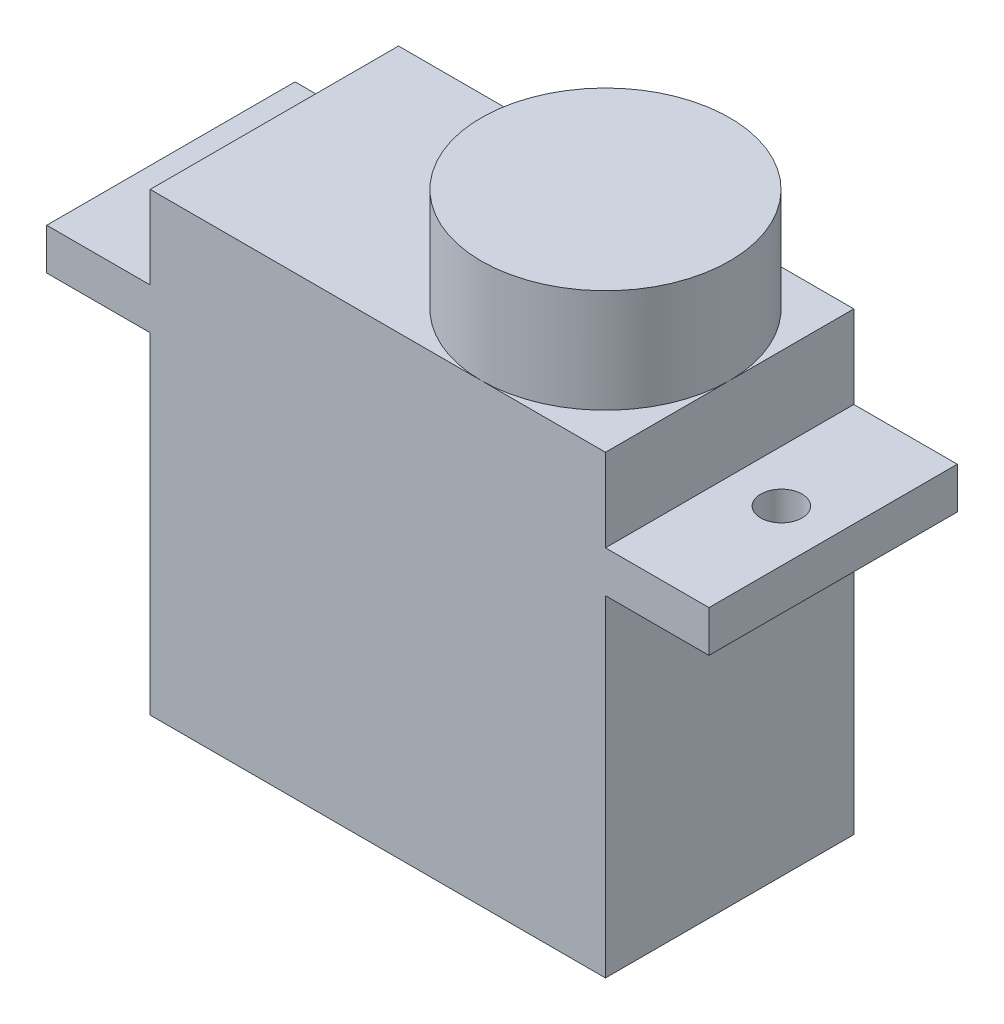
ISO-10303-21;
HEADER;
FILE_DESCRIPTION(('STEP AP214'),'2;1');
FILE_NAME('part.step','',(''),(''),'','','');
FILE_SCHEMA(('AUTOMOTIVE_DESIGN { 1 0 10303 214 1 1 1 1 }'));
ENDSEC;
DATA;
#1=APPLICATION_CONTEXT('core data for automotive mechanical design processes');
#2=APPLICATION_PROTOCOL_DEFINITION('international standard','automotive_design',2000,#1);
#3=PRODUCT_CONTEXT('',#1,'mechanical');
#4=PRODUCT('Part','Part','',(#3));
#5=PRODUCT_RELATED_PRODUCT_CATEGORY('part','',(#4));
#6=PRODUCT_DEFINITION_FORMATION('','',#4);
#7=PRODUCT_DEFINITION_CONTEXT('part definition',#1,'design');
#8=PRODUCT_DEFINITION('design','',#6,#7);
#9=PRODUCT_DEFINITION_SHAPE('','',#8);
#10=(LENGTH_UNIT() NAMED_UNIT(*) SI_UNIT(.MILLI.,.METRE.));
#11=(NAMED_UNIT(*) PLANE_ANGLE_UNIT() SI_UNIT($,.RADIAN.));
#12=(NAMED_UNIT(*) SI_UNIT($,.STERADIAN.) SOLID_ANGLE_UNIT());
#13=UNCERTAINTY_MEASURE_WITH_UNIT(LENGTH_MEASURE(1.E-05),#10,'distance_accuracy_value','');
#14=(GEOMETRIC_REPRESENTATION_CONTEXT(3) GLOBAL_UNCERTAINTY_ASSIGNED_CONTEXT((#13)) GLOBAL_UNIT_ASSIGNED_CONTEXT((#10,
#11,#12)) REPRESENTATION_CONTEXT('',''));
#15=CARTESIAN_POINT('',(0.,0.,0.));
#16=DIRECTION('',(0.,0.,1.));
#17=DIRECTION('',(1.,0.,0.));
#18=AXIS2_PLACEMENT_3D('',#15,#16,#17);
#19=CARTESIAN_POINT('',(0.,22.,-12.));
#20=DIRECTION('',(0.,-1.,0.));
#21=DIRECTION('',(0.,0.,-1.));
#22=AXIS2_PLACEMENT_3D('',#19,#20,#21);
#23=PLANE('',#22);
#24=CARTESIAN_POINT('',(16.,22.,-6.));
#25=DIRECTION('',(0.,1.,0.));
#26=DIRECTION('',(0.,0.,1.));
#27=AXIS2_PLACEMENT_3D('',#24,#25,#26);
#28=CIRCLE('',#27,6.);
#29=CARTESIAN_POINT('',(16.,22.,0.));
#30=VERTEX_POINT('',#29);
#31=CARTESIAN_POINT('',(22.,22.,-6.));
#32=VERTEX_POINT('',#31);
#33=EDGE_CURVE('E47',#30,#32,#28,.T.);
#34=ORIENTED_EDGE('',*,*,#33,.F.);
#35=DIRECTION('',(1.,0.,0.));
#36=VECTOR('',#35,1.);
#37=CARTESIAN_POINT('',(0.,22.,0.));
#38=LINE('',#37,#36);
#39=CARTESIAN_POINT('',(22.,22.,0.));
#40=VERTEX_POINT('',#39);
#41=EDGE_CURVE('E142',#30,#40,#38,.T.);
#42=ORIENTED_EDGE('',*,*,#41,.T.);
#43=DIRECTION('',(0.,0.,-1.));
#44=VECTOR('',#43,1.);
#45=CARTESIAN_POINT('',(22.,22.,0.));
#46=LINE('',#45,#44);
#47=EDGE_CURVE('E153',#40,#32,#46,.T.);
#48=ORIENTED_EDGE('',*,*,#47,.T.);
#49=EDGE_LOOP('',(#34,#42,#48));
#50=FACE_BOUND('',#49,.T.);
#51=ADVANCED_FACE('F36',(#50),#23,.F.);
#52=CARTESIAN_POINT('',(16.,22.,-12.));
#53=VERTEX_POINT('',#52);
#54=EDGE_CURVE('E11',#32,#53,#28,.T.);
#55=ORIENTED_EDGE('',*,*,#54,.F.);
#56=CARTESIAN_POINT('',(22.,22.,-12.));
#57=VERTEX_POINT('',#56);
#58=EDGE_CURVE('E141',#32,#57,#46,.T.);
#59=ORIENTED_EDGE('',*,*,#58,.T.);
#60=DIRECTION('',(-1.,0.,0.));
#61=VECTOR('',#60,1.);
#62=CARTESIAN_POINT('',(0.,22.,-12.));
#63=LINE('',#62,#61);
#64=EDGE_CURVE('E221',#57,#53,#63,.T.);
#65=ORIENTED_EDGE('',*,*,#64,.T.);
#66=EDGE_LOOP('',(#55,#59,#65));
#67=FACE_BOUND('',#66,.T.);
#68=ADVANCED_FACE('F274',(#67),#23,.F.);
#69=EDGE_CURVE('E45',#53,#30,#28,.T.);
#70=ORIENTED_EDGE('',*,*,#69,.F.);
#71=CARTESIAN_POINT('',(0.,22.,-12.));
#72=VERTEX_POINT('',#71);
#73=EDGE_CURVE('E220',#53,#72,#63,.T.);
#74=ORIENTED_EDGE('',*,*,#73,.T.);
#75=DIRECTION('',(0.,0.,1.));
#76=VECTOR('',#75,1.);
#77=CARTESIAN_POINT('',(0.,22.,0.));
#78=LINE('',#77,#76);
#79=CARTESIAN_POINT('',(0.,22.,0.));
#80=VERTEX_POINT('',#79);
#81=EDGE_CURVE('E137',#72,#80,#78,.T.);
#82=ORIENTED_EDGE('',*,*,#81,.T.);
#83=EDGE_CURVE('E133',#80,#30,#38,.T.);
#84=ORIENTED_EDGE('',*,*,#83,.T.);
#85=EDGE_LOOP('',(#70,#74,#82,#84));
#86=FACE_BOUND('',#85,.T.);
#87=ADVANCED_FACE('F135',(#86),#23,.F.);
#88=CARTESIAN_POINT('',(0.,22.,0.));
#89=DIRECTION('',(1.,0.,0.));
#90=DIRECTION('',(0.,0.,-1.));
#91=AXIS2_PLACEMENT_3D('',#88,#89,#90);
#92=PLANE('',#91);
#93=DIRECTION('',(0.,-1.,0.));
#94=VECTOR('',#93,1.);
#95=CARTESIAN_POINT('',(0.,22.,-12.));
#96=LINE('',#95,#94);
#97=CARTESIAN_POINT('',(0.,18.,-12.));
#98=VERTEX_POINT('',#97);
#99=EDGE_CURVE('E234',#72,#98,#96,.T.);
#100=ORIENTED_EDGE('',*,*,#99,.T.);
#101=DIRECTION('',(0.,0.,1.));
#102=VECTOR('',#101,1.);
#103=CARTESIAN_POINT('',(0.,18.,0.));
#104=LINE('',#103,#102);
#105=CARTESIAN_POINT('',(0.,18.,0.));
#106=VERTEX_POINT('',#105);
#107=EDGE_CURVE('E213',#98,#106,#104,.T.);
#108=ORIENTED_EDGE('',*,*,#107,.T.);
#109=DIRECTION('',(0.,-1.,0.));
#110=VECTOR('',#109,1.);
#111=CARTESIAN_POINT('',(0.,22.,0.));
#112=LINE('',#111,#110);
#113=EDGE_CURVE('E157',#80,#106,#112,.T.);
#114=ORIENTED_EDGE('',*,*,#113,.F.);
#115=ORIENTED_EDGE('',*,*,#81,.F.);
#116=EDGE_LOOP('',(#100,#108,#114,#115));
#117=FACE_BOUND('',#116,.T.);
#118=ADVANCED_FACE('F281',(#117),#92,.F.);
#119=CARTESIAN_POINT('',(22.,22.,0.));
#120=DIRECTION('',(-1.,0.,0.));
#121=DIRECTION('',(0.,0.,1.));
#122=AXIS2_PLACEMENT_3D('',#119,#120,#121);
#123=PLANE('',#122);
#124=DIRECTION('',(0.,-1.,0.));
#125=VECTOR('',#124,1.);
#126=CARTESIAN_POINT('',(22.,22.,0.));
#127=LINE('',#126,#125);
#128=CARTESIAN_POINT('',(22.,18.,0.));
#129=VERTEX_POINT('',#128);
#130=EDGE_CURVE('E148',#40,#129,#127,.T.);
#131=ORIENTED_EDGE('',*,*,#130,.T.);
#132=DIRECTION('',(0.,0.,-1.));
#133=VECTOR('',#132,1.);
#134=CARTESIAN_POINT('',(22.,18.,0.));
#135=LINE('',#134,#133);
#136=CARTESIAN_POINT('',(22.,18.,-12.));
#137=VERTEX_POINT('',#136);
#138=EDGE_CURVE('E211',#129,#137,#135,.T.);
#139=ORIENTED_EDGE('',*,*,#138,.T.);
#140=DIRECTION('',(0.,-1.,0.));
#141=VECTOR('',#140,1.);
#142=CARTESIAN_POINT('',(22.,22.,-12.));
#143=LINE('',#142,#141);
#144=EDGE_CURVE('E238',#57,#137,#143,.T.);
#145=ORIENTED_EDGE('',*,*,#144,.F.);
#146=ORIENTED_EDGE('',*,*,#58,.F.);
#147=ORIENTED_EDGE('',*,*,#47,.F.);
#148=EDGE_LOOP('',(#131,#139,#145,#146,#147));
#149=FACE_BOUND('',#148,.T.);
#150=ADVANCED_FACE('F271',(#149),#123,.F.);
#151=CARTESIAN_POINT('',(0.,16.,0.));
#152=VERTEX_POINT('',#151);
#153=CARTESIAN_POINT('',(0.,0.,0.));
#154=VERTEX_POINT('',#153);
#155=EDGE_CURVE('E158',#152,#154,#112,.T.);
#156=ORIENTED_EDGE('',*,*,#155,.F.);
#157=DIRECTION('',(0.,0.,-1.));
#158=VECTOR('',#157,1.);
#159=CARTESIAN_POINT('',(0.,16.,0.));
#160=LINE('',#159,#158);
#161=CARTESIAN_POINT('',(0.,16.,-12.));
#162=VERTEX_POINT('',#161);
#163=EDGE_CURVE('E208',#152,#162,#160,.T.);
#164=ORIENTED_EDGE('',*,*,#163,.T.);
#165=CARTESIAN_POINT('',(0.,0.,-12.));
#166=VERTEX_POINT('',#165);
#167=EDGE_CURVE('E223',#162,#166,#96,.T.);
#168=ORIENTED_EDGE('',*,*,#167,.T.);
#169=DIRECTION('',(0.,0.,1.));
#170=VECTOR('',#169,1.);
#171=CARTESIAN_POINT('',(0.,0.,0.));
#172=LINE('',#171,#170);
#173=EDGE_CURVE('E216',#166,#154,#172,.T.);
#174=ORIENTED_EDGE('',*,*,#173,.T.);
#175=EDGE_LOOP('',(#156,#164,#168,#174));
#176=FACE_BOUND('',#175,.T.);
#177=ADVANCED_FACE('F38',(#176),#92,.F.);
#178=CARTESIAN_POINT('',(0.,22.,0.));
#179=DIRECTION('',(0.,0.,-1.));
#180=DIRECTION('',(-1.,0.,0.));
#181=AXIS2_PLACEMENT_3D('',#178,#179,#180);
#182=PLANE('',#181);
#183=CARTESIAN_POINT('',(22.,16.,0.));
#184=VERTEX_POINT('',#183);
#185=CARTESIAN_POINT('',(22.,0.,0.));
#186=VERTEX_POINT('',#185);
#187=EDGE_CURVE('E241',#184,#186,#127,.T.);
#188=ORIENTED_EDGE('',*,*,#187,.F.);
#189=DIRECTION('',(1.,0.,0.));
#190=VECTOR('',#189,1.);
#191=CARTESIAN_POINT('',(-5.,16.,0.));
#192=LINE('',#191,#190);
#193=CARTESIAN_POINT('',(27.,16.,0.));
#194=VERTEX_POINT('',#193);
#195=EDGE_CURVE('E188',#184,#194,#192,.T.);
#196=ORIENTED_EDGE('',*,*,#195,.T.);
#197=DIRECTION('',(0.,1.,0.));
#198=VECTOR('',#197,1.);
#199=CARTESIAN_POINT('',(27.,18.,0.));
#200=LINE('',#199,#198);
#201=CARTESIAN_POINT('',(27.,18.,0.));
#202=VERTEX_POINT('',#201);
#203=EDGE_CURVE('E191',#194,#202,#200,.T.);
#204=ORIENTED_EDGE('',*,*,#203,.T.);
#205=DIRECTION('',(-1.,0.,0.));
#206=VECTOR('',#205,1.);
#207=CARTESIAN_POINT('',(-5.,18.,0.));
#208=LINE('',#207,#206);
#209=EDGE_CURVE('E174',#202,#129,#208,.T.);
#210=ORIENTED_EDGE('',*,*,#209,.T.);
#211=ORIENTED_EDGE('',*,*,#130,.F.);
#212=ORIENTED_EDGE('',*,*,#41,.F.);
#213=ORIENTED_EDGE('',*,*,#83,.F.);
#214=ORIENTED_EDGE('',*,*,#113,.T.);
#215=CARTESIAN_POINT('',(-5.,18.,0.));
#216=VERTEX_POINT('',#215);
#217=EDGE_CURVE('E194',#106,#216,#208,.T.);
#218=ORIENTED_EDGE('',*,*,#217,.T.);
#219=DIRECTION('',(0.,-1.,0.));
#220=VECTOR('',#219,1.);
#221=CARTESIAN_POINT('',(-5.,18.,0.));
#222=LINE('',#221,#220);
#223=CARTESIAN_POINT('',(-5.,16.,0.));
#224=VERTEX_POINT('',#223);
#225=EDGE_CURVE('E185',#216,#224,#222,.T.);
#226=ORIENTED_EDGE('',*,*,#225,.T.);
#227=EDGE_CURVE('E189',#224,#152,#192,.T.);
#228=ORIENTED_EDGE('',*,*,#227,.T.);
#229=ORIENTED_EDGE('',*,*,#155,.T.);
#230=DIRECTION('',(1.,0.,0.));
#231=VECTOR('',#230,1.);
#232=CARTESIAN_POINT('',(0.,0.,0.));
#233=LINE('',#232,#231);
#234=EDGE_CURVE('E226',#154,#186,#233,.T.);
#235=ORIENTED_EDGE('',*,*,#234,.T.);
#236=EDGE_LOOP('',(#188,#196,#204,#210,#211,#212,#213,#214,#218,#226,#228,#229,#235));
#237=FACE_BOUND('',#236,.T.);
#238=ADVANCED_FACE('F146',(#237),#182,.F.);
#239=CARTESIAN_POINT('',(22.,16.,-12.));
#240=VERTEX_POINT('',#239);
#241=CARTESIAN_POINT('',(22.,0.,-12.));
#242=VERTEX_POINT('',#241);
#243=EDGE_CURVE('E237',#240,#242,#143,.T.);
#244=ORIENTED_EDGE('',*,*,#243,.F.);
#245=DIRECTION('',(0.,0.,1.));
#246=VECTOR('',#245,1.);
#247=CARTESIAN_POINT('',(22.,16.,0.));
#248=LINE('',#247,#246);
#249=EDGE_CURVE('E199',#240,#184,#248,.T.);
#250=ORIENTED_EDGE('',*,*,#249,.T.);
#251=ORIENTED_EDGE('',*,*,#187,.T.);
#252=DIRECTION('',(0.,0.,-1.));
#253=VECTOR('',#252,1.);
#254=CARTESIAN_POINT('',(22.,0.,0.));
#255=LINE('',#254,#253);
#256=EDGE_CURVE('E229',#186,#242,#255,.T.);
#257=ORIENTED_EDGE('',*,*,#256,.T.);
#258=EDGE_LOOP('',(#244,#250,#251,#257));
#259=FACE_BOUND('',#258,.T.);
#260=ADVANCED_FACE('F245',(#259),#123,.F.);
#261=CARTESIAN_POINT('',(0.,22.,-12.));
#262=DIRECTION('',(0.,0.,1.));
#263=DIRECTION('',(1.,0.,0.));
#264=AXIS2_PLACEMENT_3D('',#261,#262,#263);
#265=PLANE('',#264);
#266=ORIENTED_EDGE('',*,*,#167,.F.);
#267=DIRECTION('',(1.,0.,0.));
#268=VECTOR('',#267,1.);
#269=CARTESIAN_POINT('',(-5.,16.,-12.));
#270=LINE('',#269,#268);
#271=CARTESIAN_POINT('',(-5.,16.,-12.));
#272=VERTEX_POINT('',#271);
#273=EDGE_CURVE('E175',#272,#162,#270,.T.);
#274=ORIENTED_EDGE('',*,*,#273,.F.);
#275=DIRECTION('',(0.,-1.,0.));
#276=VECTOR('',#275,1.);
#277=CARTESIAN_POINT('',(-5.,18.,-12.));
#278=LINE('',#277,#276);
#279=CARTESIAN_POINT('',(-5.,18.,-12.));
#280=VERTEX_POINT('',#279);
#281=EDGE_CURVE('E170',#280,#272,#278,.T.);
#282=ORIENTED_EDGE('',*,*,#281,.F.);
#283=DIRECTION('',(-1.,0.,0.));
#284=VECTOR('',#283,1.);
#285=CARTESIAN_POINT('',(-5.,18.,-12.));
#286=LINE('',#285,#284);
#287=EDGE_CURVE('E180',#98,#280,#286,.T.);
#288=ORIENTED_EDGE('',*,*,#287,.F.);
#289=ORIENTED_EDGE('',*,*,#99,.F.);
#290=ORIENTED_EDGE('',*,*,#73,.F.);
#291=ORIENTED_EDGE('',*,*,#64,.F.);
#292=ORIENTED_EDGE('',*,*,#144,.T.);
#293=CARTESIAN_POINT('',(27.,18.,-12.));
#294=VERTEX_POINT('',#293);
#295=EDGE_CURVE('E181',#294,#137,#286,.T.);
#296=ORIENTED_EDGE('',*,*,#295,.F.);
#297=DIRECTION('',(0.,1.,0.));
#298=VECTOR('',#297,1.);
#299=CARTESIAN_POINT('',(27.,18.,-12.));
#300=LINE('',#299,#298);
#301=CARTESIAN_POINT('',(27.,16.,-12.));
#302=VERTEX_POINT('',#301);
#303=EDGE_CURVE('E177',#302,#294,#300,.T.);
#304=ORIENTED_EDGE('',*,*,#303,.F.);
#305=EDGE_CURVE('E173',#240,#302,#270,.T.);
#306=ORIENTED_EDGE('',*,*,#305,.F.);
#307=ORIENTED_EDGE('',*,*,#243,.T.);
#308=DIRECTION('',(-1.,0.,0.));
#309=VECTOR('',#308,1.);
#310=CARTESIAN_POINT('',(0.,0.,-12.));
#311=LINE('',#310,#309);
#312=EDGE_CURVE('E217',#242,#166,#311,.T.);
#313=ORIENTED_EDGE('',*,*,#312,.T.);
#314=EDGE_LOOP('',(#266,#274,#282,#288,#289,#290,#291,#292,#296,#304,#306,#307,#313));
#315=FACE_BOUND('',#314,.T.);
#316=ADVANCED_FACE('F257',(#315),#265,.F.);
#317=CARTESIAN_POINT('',(0.,0.,-12.));
#318=DIRECTION('',(0.,-1.,0.));
#319=DIRECTION('',(0.,0.,-1.));
#320=AXIS2_PLACEMENT_3D('',#317,#318,#319);
#321=PLANE('',#320);
#322=ORIENTED_EDGE('',*,*,#173,.F.);
#323=ORIENTED_EDGE('',*,*,#312,.F.);
#324=ORIENTED_EDGE('',*,*,#256,.F.);
#325=ORIENTED_EDGE('',*,*,#234,.F.);
#326=EDGE_LOOP('',(#322,#323,#324,#325));
#327=FACE_BOUND('',#326,.T.);
#328=ADVANCED_FACE('F254',(#327),#321,.T.);
#329=CARTESIAN_POINT('',(27.,18.,-12.));
#330=DIRECTION('',(1.,0.,0.));
#331=DIRECTION('',(0.,1.,0.));
#332=AXIS2_PLACEMENT_3D('',#329,#330,#331);
#333=PLANE('',#332);
#334=ORIENTED_EDGE('',*,*,#203,.F.);
#335=DIRECTION('',(0.,0.,1.));
#336=VECTOR('',#335,1.);
#337=CARTESIAN_POINT('',(27.,16.,-12.));
#338=LINE('',#337,#336);
#339=EDGE_CURVE('E202',#302,#194,#338,.T.);
#340=ORIENTED_EDGE('',*,*,#339,.F.);
#341=ORIENTED_EDGE('',*,*,#303,.T.);
#342=DIRECTION('',(0.,0.,1.));
#343=VECTOR('',#342,1.);
#344=CARTESIAN_POINT('',(27.,18.,-12.));
#345=LINE('',#344,#343);
#346=EDGE_CURVE('E200',#294,#202,#345,.T.);
#347=ORIENTED_EDGE('',*,*,#346,.T.);
#348=EDGE_LOOP('',(#334,#340,#341,#347));
#349=FACE_BOUND('',#348,.T.);
#350=ADVANCED_FACE('F288',(#349),#333,.T.);
#351=CARTESIAN_POINT('',(-5.,16.,-12.));
#352=DIRECTION('',(0.,-1.,0.));
#353=DIRECTION('',(1.,0.,0.));
#354=AXIS2_PLACEMENT_3D('',#351,#352,#353);
#355=PLANE('',#354);
#356=CARTESIAN_POINT('',(24.5,16.,-6.));
#357=DIRECTION('',(0.,-1.,0.));
#358=DIRECTION('',(1.,0.,0.));
#359=AXIS2_PLACEMENT_3D('',#356,#357,#358);
#360=CIRCLE('',#359,1.);
#361=CARTESIAN_POINT('',(25.5,16.,-6.));
#362=VERTEX_POINT('',#361);
#363=EDGE_CURVE('E164',#362,#362,#360,.T.);
#364=ORIENTED_EDGE('',*,*,#363,.F.);
#365=EDGE_LOOP('',(#364));
#366=FACE_BOUND('',#365,.T.);
#367=ORIENTED_EDGE('',*,*,#249,.F.);
#368=ORIENTED_EDGE('',*,*,#305,.T.);
#369=ORIENTED_EDGE('',*,*,#339,.T.);
#370=ORIENTED_EDGE('',*,*,#195,.F.);
#371=EDGE_LOOP('',(#367,#368,#369,#370));
#372=FACE_BOUND('',#371,.T.);
#373=ADVANCED_FACE('F262',(#366,#372),#355,.T.);
#374=CARTESIAN_POINT('',(-5.,18.,-12.));
#375=DIRECTION('',(0.,1.,0.));
#376=DIRECTION('',(0.,0.,1.));
#377=AXIS2_PLACEMENT_3D('',#374,#375,#376);
#378=PLANE('',#377);
#379=CARTESIAN_POINT('',(24.5,18.,-6.));
#380=DIRECTION('',(0.,1.,0.));
#381=DIRECTION('',(0.,0.,1.));
#382=AXIS2_PLACEMENT_3D('',#379,#380,#381);
#383=CIRCLE('',#382,1.);
#384=CARTESIAN_POINT('',(24.5,18.,-5.));
#385=VERTEX_POINT('',#384);
#386=EDGE_CURVE('E161',#385,#385,#383,.T.);
#387=ORIENTED_EDGE('',*,*,#386,.F.);
#388=EDGE_LOOP('',(#387));
#389=FACE_BOUND('',#388,.T.);
#390=ORIENTED_EDGE('',*,*,#138,.F.);
#391=ORIENTED_EDGE('',*,*,#209,.F.);
#392=ORIENTED_EDGE('',*,*,#346,.F.);
#393=ORIENTED_EDGE('',*,*,#295,.T.);
#394=EDGE_LOOP('',(#390,#391,#392,#393));
#395=FACE_BOUND('',#394,.T.);
#396=ADVANCED_FACE('F268',(#389,#395),#378,.T.);
#397=CARTESIAN_POINT('',(-2.5,18.,-6.));
#398=DIRECTION('',(0.,1.,0.));
#399=DIRECTION('',(0.,0.,1.));
#400=AXIS2_PLACEMENT_3D('',#397,#398,#399);
#401=CIRCLE('',#400,1.);
#402=CARTESIAN_POINT('',(-2.5,18.,-5.));
#403=VERTEX_POINT('',#402);
#404=EDGE_CURVE('E167',#403,#403,#401,.T.);
#405=ORIENTED_EDGE('',*,*,#404,.F.);
#406=EDGE_LOOP('',(#405));
#407=FACE_BOUND('',#406,.T.);
#408=ORIENTED_EDGE('',*,*,#107,.F.);
#409=ORIENTED_EDGE('',*,*,#287,.T.);
#410=DIRECTION('',(0.,0.,1.));
#411=VECTOR('',#410,1.);
#412=CARTESIAN_POINT('',(-5.,18.,-12.));
#413=LINE('',#412,#411);
#414=EDGE_CURVE('E196',#280,#216,#413,.T.);
#415=ORIENTED_EDGE('',*,*,#414,.T.);
#416=ORIENTED_EDGE('',*,*,#217,.F.);
#417=EDGE_LOOP('',(#408,#409,#415,#416));
#418=FACE_BOUND('',#417,.T.);
#419=ADVANCED_FACE('F308',(#407,#418),#378,.T.);
#420=CARTESIAN_POINT('',(-2.5,16.,-6.));
#421=DIRECTION('',(0.,-1.,0.));
#422=DIRECTION('',(1.,0.,0.));
#423=AXIS2_PLACEMENT_3D('',#420,#421,#422);
#424=CIRCLE('',#423,1.);
#425=CARTESIAN_POINT('',(-1.5,16.,-6.));
#426=VERTEX_POINT('',#425);
#427=EDGE_CURVE('E40',#426,#426,#424,.T.);
#428=ORIENTED_EDGE('',*,*,#427,.F.);
#429=EDGE_LOOP('',(#428));
#430=FACE_BOUND('',#429,.T.);
#431=ORIENTED_EDGE('',*,*,#163,.F.);
#432=ORIENTED_EDGE('',*,*,#227,.F.);
#433=DIRECTION('',(0.,0.,1.));
#434=VECTOR('',#433,1.);
#435=CARTESIAN_POINT('',(-5.,16.,-12.));
#436=LINE('',#435,#434);
#437=EDGE_CURVE('E184',#272,#224,#436,.T.);
#438=ORIENTED_EDGE('',*,*,#437,.F.);
#439=ORIENTED_EDGE('',*,*,#273,.T.);
#440=EDGE_LOOP('',(#431,#432,#438,#439));
#441=FACE_BOUND('',#440,.T.);
#442=ADVANCED_FACE('F314',(#430,#441),#355,.T.);
#443=CARTESIAN_POINT('',(-5.,18.,-12.));
#444=DIRECTION('',(-1.,0.,0.));
#445=DIRECTION('',(0.,0.,1.));
#446=AXIS2_PLACEMENT_3D('',#443,#444,#445);
#447=PLANE('',#446);
#448=ORIENTED_EDGE('',*,*,#225,.F.);
#449=ORIENTED_EDGE('',*,*,#414,.F.);
#450=ORIENTED_EDGE('',*,*,#281,.T.);
#451=ORIENTED_EDGE('',*,*,#437,.T.);
#452=EDGE_LOOP('',(#448,#449,#450,#451));
#453=FACE_BOUND('',#452,.T.);
#454=ADVANCED_FACE('F284',(#453),#447,.T.);
#455=CARTESIAN_POINT('',(-2.5,-4.,-6.));
#456=DIRECTION('',(0.,1.,0.));
#457=DIRECTION('',(0.,0.,1.));
#458=AXIS2_PLACEMENT_3D('',#455,#456,#457);
#459=CYLINDRICAL_SURFACE('',#458,1.);
#460=ORIENTED_EDGE('',*,*,#427,.T.);
#461=EDGE_LOOP('',(#460));
#462=FACE_BOUND('',#461,.T.);
#463=ORIENTED_EDGE('',*,*,#404,.T.);
#464=EDGE_LOOP('',(#463));
#465=FACE_BOUND('',#464,.T.);
#466=ADVANCED_FACE('F321',(#462,#465),#459,.F.);
#467=CARTESIAN_POINT('',(24.5,-4.,-6.));
#468=DIRECTION('',(0.,1.,0.));
#469=DIRECTION('',(0.,0.,1.));
#470=AXIS2_PLACEMENT_3D('',#467,#468,#469);
#471=CYLINDRICAL_SURFACE('',#470,1.);
#472=ORIENTED_EDGE('',*,*,#363,.T.);
#473=EDGE_LOOP('',(#472));
#474=FACE_BOUND('',#473,.T.);
#475=ORIENTED_EDGE('',*,*,#386,.T.);
#476=EDGE_LOOP('',(#475));
#477=FACE_BOUND('',#476,.T.);
#478=ADVANCED_FACE('F335',(#474,#477),#471,.F.);
#479=CARTESIAN_POINT('',(16.,27.,-6.));
#480=DIRECTION('',(0.,-1.,0.));
#481=DIRECTION('',(0.,0.,-1.));
#482=AXIS2_PLACEMENT_3D('',#479,#480,#481);
#483=CYLINDRICAL_SURFACE('',#482,6.);
#484=CARTESIAN_POINT('',(16.,27.,-6.));
#485=DIRECTION('',(0.,1.,0.));
#486=DIRECTION('',(0.,0.,1.));
#487=AXIS2_PLACEMENT_3D('',#484,#485,#486);
#488=CIRCLE('',#487,6.);
#489=CARTESIAN_POINT('',(16.,27.,0.));
#490=VERTEX_POINT('',#489);
#491=EDGE_CURVE('E155',#490,#490,#488,.T.);
#492=ORIENTED_EDGE('',*,*,#491,.F.);
#493=EDGE_LOOP('',(#492));
#494=FACE_BOUND('',#493,.T.);
#495=ORIENTED_EDGE('',*,*,#33,.T.);
#496=ORIENTED_EDGE('',*,*,#54,.T.);
#497=ORIENTED_EDGE('',*,*,#69,.T.);
#498=EDGE_LOOP('',(#495,#496,#497));
#499=FACE_BOUND('',#498,.T.);
#500=ADVANCED_FACE('F156',(#494,#499),#483,.T.);
#501=CARTESIAN_POINT('',(16.,27.,-6.));
#502=DIRECTION('',(0.,1.,0.));
#503=DIRECTION('',(0.,0.,1.));
#504=AXIS2_PLACEMENT_3D('',#501,#502,#503);
#505=PLANE('',#504);
#506=ORIENTED_EDGE('',*,*,#491,.T.);
#507=EDGE_LOOP('',(#506));
#508=FACE_BOUND('',#507,.T.);
#509=ADVANCED_FACE('F344',(#508),#505,.T.);
#510=CLOSED_SHELL('',(#51,#68,#87,#118,#150,#177,#238,#260,#316,#328,#350,#373,#396,#419,#442,
#454,#466,#478,#500,#509));
#511=MANIFOLD_SOLID_BREP('B2',#510);
#512=ADVANCED_BREP_SHAPE_REPRESENTATION('',(#18,#511),#14);
#513=SHAPE_DEFINITION_REPRESENTATION(#9,#512);
ENDSEC;
END-ISO-10303-21;
